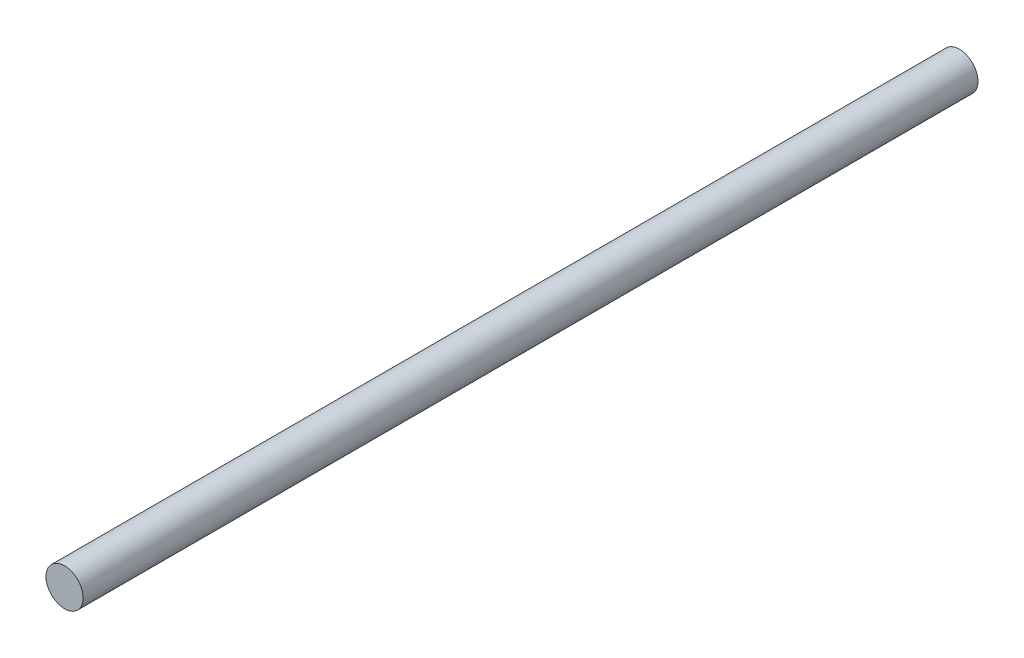
ISO-10303-21;
HEADER;
FILE_DESCRIPTION(('STEP AP214'),'2;1');
FILE_NAME('part.step','',(''),(''),'','','');
FILE_SCHEMA(('AUTOMOTIVE_DESIGN { 1 0 10303 214 1 1 1 1 }'));
ENDSEC;
DATA;
#1=APPLICATION_CONTEXT('core data for automotive mechanical design processes');
#2=APPLICATION_PROTOCOL_DEFINITION('international standard','automotive_design',2000,#1);
#3=PRODUCT_CONTEXT('',#1,'mechanical');
#4=PRODUCT('Part','Part','',(#3));
#5=PRODUCT_RELATED_PRODUCT_CATEGORY('part','',(#4));
#6=PRODUCT_DEFINITION_FORMATION('','',#4);
#7=PRODUCT_DEFINITION_CONTEXT('part definition',#1,'design');
#8=PRODUCT_DEFINITION('design','',#6,#7);
#9=PRODUCT_DEFINITION_SHAPE('','',#8);
#10=(LENGTH_UNIT() NAMED_UNIT(*) SI_UNIT(.MILLI.,.METRE.));
#11=(NAMED_UNIT(*) PLANE_ANGLE_UNIT() SI_UNIT($,.RADIAN.));
#12=(NAMED_UNIT(*) SI_UNIT($,.STERADIAN.) SOLID_ANGLE_UNIT());
#13=UNCERTAINTY_MEASURE_WITH_UNIT(LENGTH_MEASURE(1.E-05),#10,'distance_accuracy_value','');
#14=(GEOMETRIC_REPRESENTATION_CONTEXT(3) GLOBAL_UNCERTAINTY_ASSIGNED_CONTEXT((#13)) GLOBAL_UNIT_ASSIGNED_CONTEXT((#10,
#11,#12)) REPRESENTATION_CONTEXT('',''));
#15=CARTESIAN_POINT('',(0.,0.,0.));
#16=DIRECTION('',(0.,0.,1.));
#17=DIRECTION('',(1.,0.,0.));
#18=AXIS2_PLACEMENT_3D('',#15,#16,#17);
#19=CARTESIAN_POINT('',(0.,0.,288.5));
#20=DIRECTION('',(0.,0.,-1.));
#21=DIRECTION('',(-1.,0.,0.));
#22=AXIS2_PLACEMENT_3D('',#19,#20,#21);
#23=CYLINDRICAL_SURFACE('',#22,6.);
#24=CARTESIAN_POINT('',(0.,0.,288.5));
#25=DIRECTION('',(0.,0.,1.));
#26=DIRECTION('',(1.,0.,0.));
#27=AXIS2_PLACEMENT_3D('',#24,#25,#26);
#28=CIRCLE('',#27,6.);
#29=CARTESIAN_POINT('',(6.,0.,288.5));
#30=VERTEX_POINT('',#29);
#31=EDGE_CURVE('E10',#30,#30,#28,.T.);
#32=ORIENTED_EDGE('',*,*,#31,.F.);
#33=EDGE_LOOP('',(#32));
#34=FACE_BOUND('',#33,.T.);
#35=CARTESIAN_POINT('',(0.,0.,0.));
#36=DIRECTION('',(0.,0.,1.));
#37=DIRECTION('',(1.,0.,0.));
#38=AXIS2_PLACEMENT_3D('',#35,#36,#37);
#39=CIRCLE('',#38,6.);
#40=CARTESIAN_POINT('',(6.,0.,0.));
#41=VERTEX_POINT('',#40);
#42=EDGE_CURVE('E35',#41,#41,#39,.T.);
#43=ORIENTED_EDGE('',*,*,#42,.T.);
#44=EDGE_LOOP('',(#43));
#45=FACE_BOUND('',#44,.T.);
#46=ADVANCED_FACE('F32',(#34,#45),#23,.T.);
#47=CARTESIAN_POINT('',(0.,0.,288.5));
#48=DIRECTION('',(0.,0.,1.));
#49=DIRECTION('',(1.,0.,0.));
#50=AXIS2_PLACEMENT_3D('',#47,#48,#49);
#51=PLANE('',#50);
#52=ORIENTED_EDGE('',*,*,#31,.T.);
#53=EDGE_LOOP('',(#52));
#54=FACE_BOUND('',#53,.T.);
#55=ADVANCED_FACE('F47',(#54),#51,.T.);
#56=CARTESIAN_POINT('',(0.,0.,0.));
#57=DIRECTION('',(0.,0.,1.));
#58=DIRECTION('',(1.,0.,0.));
#59=AXIS2_PLACEMENT_3D('',#56,#57,#58);
#60=PLANE('',#59);
#61=ORIENTED_EDGE('',*,*,#42,.F.);
#62=EDGE_LOOP('',(#61));
#63=FACE_BOUND('',#62,.T.);
#64=ADVANCED_FACE('F45',(#63),#60,.F.);
#65=CLOSED_SHELL('',(#46,#55,#64));
#66=MANIFOLD_SOLID_BREP('B2',#65);
#67=ADVANCED_BREP_SHAPE_REPRESENTATION('',(#18,#66),#14);
#68=SHAPE_DEFINITION_REPRESENTATION(#9,#67);
ENDSEC;
END-ISO-10303-21;
